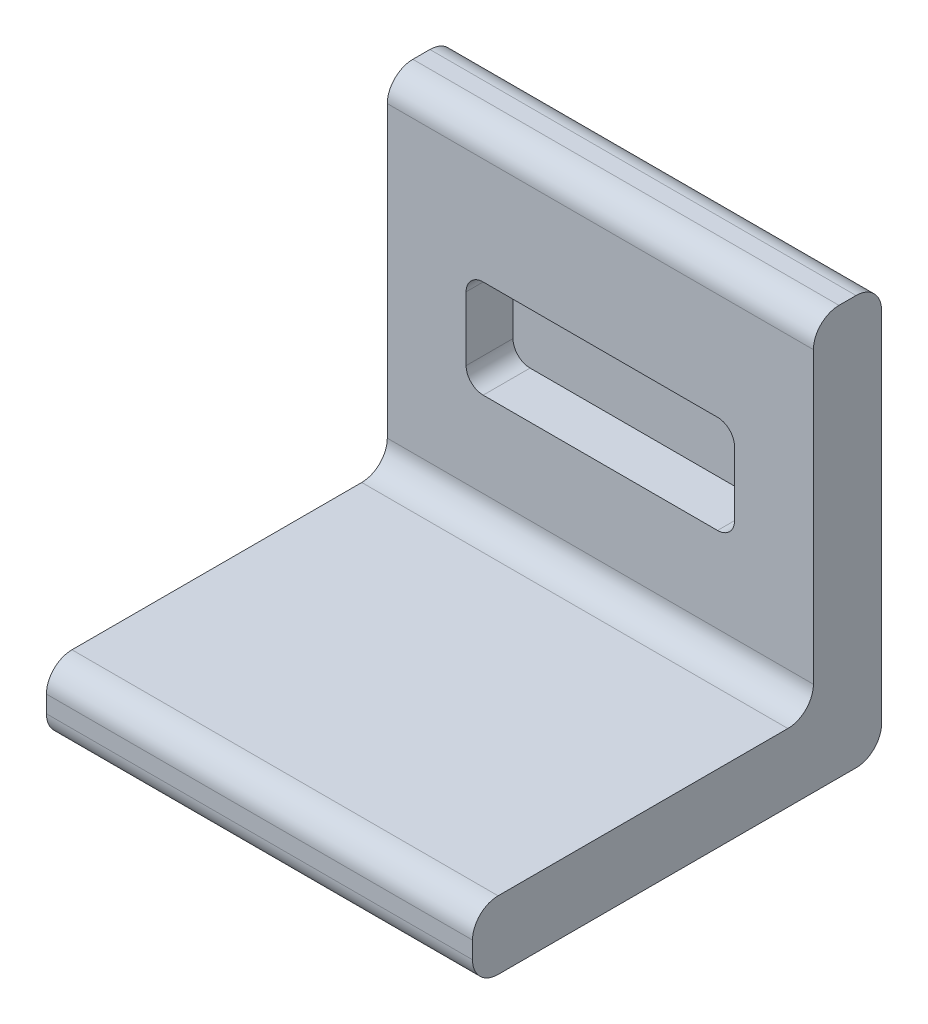
ISO-10303-21;
HEADER;
FILE_DESCRIPTION(('STEP AP214'),'2;1');
FILE_NAME('part.step','',(''),(''),'','','');
FILE_SCHEMA(('AUTOMOTIVE_DESIGN { 1 0 10303 214 1 1 1 1 }'));
ENDSEC;
DATA;
#1=APPLICATION_CONTEXT('core data for automotive mechanical design processes');
#2=APPLICATION_PROTOCOL_DEFINITION('international standard','automotive_design',2000,#1);
#3=PRODUCT_CONTEXT('',#1,'mechanical');
#4=PRODUCT('Part','Part','',(#3));
#5=PRODUCT_RELATED_PRODUCT_CATEGORY('part','',(#4));
#6=PRODUCT_DEFINITION_FORMATION('','',#4);
#7=PRODUCT_DEFINITION_CONTEXT('part definition',#1,'design');
#8=PRODUCT_DEFINITION('design','',#6,#7);
#9=PRODUCT_DEFINITION_SHAPE('','',#8);
#10=(LENGTH_UNIT() NAMED_UNIT(*) SI_UNIT(.MILLI.,.METRE.));
#11=(NAMED_UNIT(*) PLANE_ANGLE_UNIT() SI_UNIT($,.RADIAN.));
#12=(NAMED_UNIT(*) SI_UNIT($,.STERADIAN.) SOLID_ANGLE_UNIT());
#13=UNCERTAINTY_MEASURE_WITH_UNIT(LENGTH_MEASURE(1.E-05),#10,'distance_accuracy_value','');
#14=(GEOMETRIC_REPRESENTATION_CONTEXT(3) GLOBAL_UNCERTAINTY_ASSIGNED_CONTEXT((#13)) GLOBAL_UNIT_ASSIGNED_CONTEXT((#10,
#11,#12)) REPRESENTATION_CONTEXT('',''));
#15=CARTESIAN_POINT('',(0.,0.,0.));
#16=DIRECTION('',(0.,0.,1.));
#17=DIRECTION('',(1.,0.,0.));
#18=AXIS2_PLACEMENT_3D('',#15,#16,#17);
#19=CARTESIAN_POINT('',(-25.,8.,-40.));
#20=DIRECTION('',(1.,0.,0.));
#21=DIRECTION('',(0.,0.,-1.));
#22=AXIS2_PLACEMENT_3D('',#19,#20,#21);
#23=PLANE('',#22);
#24=DIRECTION('',(0.,-1.,0.));
#25=VECTOR('',#24,1.);
#26=CARTESIAN_POINT('',(-25.,8.,0.));
#27=LINE('',#26,#25);
#28=CARTESIAN_POINT('',(-25.,5.,0.));
#29=VERTEX_POINT('',#28);
#30=CARTESIAN_POINT('',(-25.,3.,0.));
#31=VERTEX_POINT('',#30);
#32=EDGE_CURVE('E265',#29,#31,#27,.T.);
#33=ORIENTED_EDGE('',*,*,#32,.F.);
#34=CARTESIAN_POINT('',(-25.,5.,-3.));
#35=DIRECTION('',(1.,0.,0.));
#36=DIRECTION('',(0.,0.,-1.));
#37=AXIS2_PLACEMENT_3D('',#34,#35,#36);
#38=CIRCLE('',#37,3.);
#39=CARTESIAN_POINT('',(-25.,8.,-3.));
#40=VERTEX_POINT('',#39);
#41=EDGE_CURVE('E355',#29,#40,#38,.F.);
#42=ORIENTED_EDGE('',*,*,#41,.T.);
#43=DIRECTION('',(0.,0.,1.));
#44=VECTOR('',#43,1.);
#45=CARTESIAN_POINT('',(-25.,8.,-40.));
#46=LINE('',#45,#44);
#47=CARTESIAN_POINT('',(-25.,8.,-37.));
#48=VERTEX_POINT('',#47);
#49=EDGE_CURVE('E246',#48,#40,#46,.T.);
#50=ORIENTED_EDGE('',*,*,#49,.F.);
#51=CARTESIAN_POINT('',(-25.,11.,-37.));
#52=DIRECTION('',(1.,0.,0.));
#53=DIRECTION('',(0.,0.,-1.));
#54=AXIS2_PLACEMENT_3D('',#51,#52,#53);
#55=CIRCLE('',#54,3.);
#56=CARTESIAN_POINT('',(-25.,11.,-40.));
#57=VERTEX_POINT('',#56);
#58=EDGE_CURVE('E48',#48,#57,#55,.T.);
#59=ORIENTED_EDGE('',*,*,#58,.T.);
#60=DIRECTION('',(0.,1.,0.));
#61=VECTOR('',#60,1.);
#62=CARTESIAN_POINT('',(-25.,48.,-40.));
#63=LINE('',#62,#61);
#64=CARTESIAN_POINT('',(-25.,45.,-40.));
#65=VERTEX_POINT('',#64);
#66=EDGE_CURVE('E226',#57,#65,#63,.T.);
#67=ORIENTED_EDGE('',*,*,#66,.T.);
#68=CARTESIAN_POINT('',(-25.,45.,-43.));
#69=DIRECTION('',(1.,0.,0.));
#70=DIRECTION('',(0.,0.,-1.));
#71=AXIS2_PLACEMENT_3D('',#68,#69,#70);
#72=CIRCLE('',#71,3.);
#73=CARTESIAN_POINT('',(-25.,48.,-43.));
#74=VERTEX_POINT('',#73);
#75=EDGE_CURVE('E352',#65,#74,#72,.F.);
#76=ORIENTED_EDGE('',*,*,#75,.T.);
#77=DIRECTION('',(0.,0.,1.));
#78=VECTOR('',#77,1.);
#79=CARTESIAN_POINT('',(-25.,48.,-48.));
#80=LINE('',#79,#78);
#81=CARTESIAN_POINT('',(-25.,48.,-45.));
#82=VERTEX_POINT('',#81);
#83=EDGE_CURVE('E241',#82,#74,#80,.T.);
#84=ORIENTED_EDGE('',*,*,#83,.F.);
#85=CARTESIAN_POINT('',(-25.,45.,-45.));
#86=DIRECTION('',(1.,0.,0.));
#87=DIRECTION('',(0.,0.,-1.));
#88=AXIS2_PLACEMENT_3D('',#85,#86,#87);
#89=CIRCLE('',#88,3.);
#90=CARTESIAN_POINT('',(-25.,45.,-48.));
#91=VERTEX_POINT('',#90);
#92=EDGE_CURVE('E55',#82,#91,#89,.F.);
#93=ORIENTED_EDGE('',*,*,#92,.T.);
#94=DIRECTION('',(0.,1.,0.));
#95=VECTOR('',#94,1.);
#96=CARTESIAN_POINT('',(-25.,48.,-48.));
#97=LINE('',#96,#95);
#98=CARTESIAN_POINT('',(-25.,3.,-48.));
#99=VERTEX_POINT('',#98);
#100=EDGE_CURVE('E225',#99,#91,#97,.T.);
#101=ORIENTED_EDGE('',*,*,#100,.F.);
#102=CARTESIAN_POINT('',(-25.,3.,-45.));
#103=DIRECTION('',(1.,0.,0.));
#104=DIRECTION('',(0.,0.,-1.));
#105=AXIS2_PLACEMENT_3D('',#102,#103,#104);
#106=CIRCLE('',#105,3.);
#107=CARTESIAN_POINT('',(-25.,0.,-45.));
#108=VERTEX_POINT('',#107);
#109=EDGE_CURVE('E63',#99,#108,#106,.F.);
#110=ORIENTED_EDGE('',*,*,#109,.T.);
#111=DIRECTION('',(0.,0.,1.));
#112=VECTOR('',#111,1.);
#113=CARTESIAN_POINT('',(-25.,0.,-40.));
#114=LINE('',#113,#112);
#115=CARTESIAN_POINT('',(-25.,0.,-3.));
#116=VERTEX_POINT('',#115);
#117=EDGE_CURVE('E245',#108,#116,#114,.T.);
#118=ORIENTED_EDGE('',*,*,#117,.T.);
#119=CARTESIAN_POINT('',(-25.,3.,-3.));
#120=DIRECTION('',(1.,0.,0.));
#121=DIRECTION('',(0.,0.,-1.));
#122=AXIS2_PLACEMENT_3D('',#119,#120,#121);
#123=CIRCLE('',#122,3.);
#124=EDGE_CURVE('E347',#116,#31,#123,.F.);
#125=ORIENTED_EDGE('',*,*,#124,.T.);
#126=EDGE_LOOP('',(#33,#42,#50,#59,#67,#76,#84,#93,#101,#110,#118,#125));
#127=FACE_BOUND('',#126,.T.);
#128=ADVANCED_FACE('F39',(#127),#23,.F.);
#129=CARTESIAN_POINT('',(-25.,8.,0.));
#130=DIRECTION('',(0.,0.,-1.));
#131=DIRECTION('',(-1.,0.,0.));
#132=AXIS2_PLACEMENT_3D('',#129,#130,#131);
#133=PLANE('',#132);
#134=DIRECTION('',(0.,-1.,0.));
#135=VECTOR('',#134,1.);
#136=CARTESIAN_POINT('',(25.,8.,0.));
#137=LINE('',#136,#135);
#138=CARTESIAN_POINT('',(25.,5.,0.));
#139=VERTEX_POINT('',#138);
#140=CARTESIAN_POINT('',(25.,3.,0.));
#141=VERTEX_POINT('',#140);
#142=EDGE_CURVE('E255',#139,#141,#137,.T.);
#143=ORIENTED_EDGE('',*,*,#142,.F.);
#144=DIRECTION('',(1.,0.,0.));
#145=VECTOR('',#144,1.);
#146=CARTESIAN_POINT('',(-25.,5.,0.));
#147=LINE('',#146,#145);
#148=EDGE_CURVE('E342',#139,#29,#147,.F.);
#149=ORIENTED_EDGE('',*,*,#148,.T.);
#150=ORIENTED_EDGE('',*,*,#32,.T.);
#151=DIRECTION('',(1.,0.,0.));
#152=VECTOR('',#151,1.);
#153=CARTESIAN_POINT('',(-25.,3.,0.));
#154=LINE('',#153,#152);
#155=EDGE_CURVE('E338',#31,#141,#154,.T.);
#156=ORIENTED_EDGE('',*,*,#155,.T.);
#157=EDGE_LOOP('',(#143,#149,#150,#156));
#158=FACE_BOUND('',#157,.T.);
#159=ADVANCED_FACE('F401',(#158),#133,.F.);
#160=CARTESIAN_POINT('',(25.,8.,-40.));
#161=DIRECTION('',(-1.,0.,0.));
#162=DIRECTION('',(0.,0.,1.));
#163=AXIS2_PLACEMENT_3D('',#160,#161,#162);
#164=PLANE('',#163);
#165=DIRECTION('',(0.,0.,-1.));
#166=VECTOR('',#165,1.);
#167=CARTESIAN_POINT('',(25.,8.,-40.));
#168=LINE('',#167,#166);
#169=CARTESIAN_POINT('',(25.,8.,-3.));
#170=VERTEX_POINT('',#169);
#171=CARTESIAN_POINT('',(25.,8.,-37.));
#172=VERTEX_POINT('',#171);
#173=EDGE_CURVE('E250',#170,#172,#168,.T.);
#174=ORIENTED_EDGE('',*,*,#173,.F.);
#175=CARTESIAN_POINT('',(25.,5.,-3.));
#176=DIRECTION('',(-1.,0.,0.));
#177=DIRECTION('',(0.,0.,1.));
#178=AXIS2_PLACEMENT_3D('',#175,#176,#177);
#179=CIRCLE('',#178,3.);
#180=EDGE_CURVE('E335',#170,#139,#179,.F.);
#181=ORIENTED_EDGE('',*,*,#180,.T.);
#182=ORIENTED_EDGE('',*,*,#142,.T.);
#183=CARTESIAN_POINT('',(25.,3.,-3.));
#184=DIRECTION('',(-1.,0.,0.));
#185=DIRECTION('',(0.,0.,1.));
#186=AXIS2_PLACEMENT_3D('',#183,#184,#185);
#187=CIRCLE('',#186,3.);
#188=CARTESIAN_POINT('',(25.,0.,-3.));
#189=VERTEX_POINT('',#188);
#190=EDGE_CURVE('E326',#141,#189,#187,.F.);
#191=ORIENTED_EDGE('',*,*,#190,.T.);
#192=DIRECTION('',(0.,0.,-1.));
#193=VECTOR('',#192,1.);
#194=CARTESIAN_POINT('',(25.,0.,-40.));
#195=LINE('',#194,#193);
#196=CARTESIAN_POINT('',(25.,0.,-45.));
#197=VERTEX_POINT('',#196);
#198=EDGE_CURVE('E251',#189,#197,#195,.T.);
#199=ORIENTED_EDGE('',*,*,#198,.T.);
#200=CARTESIAN_POINT('',(25.,3.,-45.));
#201=DIRECTION('',(-1.,0.,0.));
#202=DIRECTION('',(0.,0.,1.));
#203=AXIS2_PLACEMENT_3D('',#200,#201,#202);
#204=CIRCLE('',#203,3.);
#205=CARTESIAN_POINT('',(25.,3.,-48.));
#206=VERTEX_POINT('',#205);
#207=EDGE_CURVE('E323',#197,#206,#204,.F.);
#208=ORIENTED_EDGE('',*,*,#207,.T.);
#209=DIRECTION('',(0.,-1.,0.));
#210=VECTOR('',#209,1.);
#211=CARTESIAN_POINT('',(25.,48.,-48.));
#212=LINE('',#211,#210);
#213=CARTESIAN_POINT('',(25.,45.,-48.));
#214=VERTEX_POINT('',#213);
#215=EDGE_CURVE('E221',#214,#206,#212,.T.);
#216=ORIENTED_EDGE('',*,*,#215,.F.);
#217=CARTESIAN_POINT('',(25.,45.,-45.));
#218=DIRECTION('',(-1.,0.,0.));
#219=DIRECTION('',(0.,0.,1.));
#220=AXIS2_PLACEMENT_3D('',#217,#218,#219);
#221=CIRCLE('',#220,3.);
#222=CARTESIAN_POINT('',(25.,48.,-45.));
#223=VERTEX_POINT('',#222);
#224=EDGE_CURVE('E329',#214,#223,#221,.F.);
#225=ORIENTED_EDGE('',*,*,#224,.T.);
#226=DIRECTION('',(0.,0.,1.));
#227=VECTOR('',#226,1.);
#228=CARTESIAN_POINT('',(25.,48.,-48.));
#229=LINE('',#228,#227);
#230=CARTESIAN_POINT('',(25.,48.,-43.));
#231=VERTEX_POINT('',#230);
#232=EDGE_CURVE('E229',#223,#231,#229,.T.);
#233=ORIENTED_EDGE('',*,*,#232,.T.);
#234=CARTESIAN_POINT('',(25.,45.,-43.));
#235=DIRECTION('',(-1.,0.,0.));
#236=DIRECTION('',(0.,0.,1.));
#237=AXIS2_PLACEMENT_3D('',#234,#235,#236);
#238=CIRCLE('',#237,3.);
#239=CARTESIAN_POINT('',(25.,45.,-40.));
#240=VERTEX_POINT('',#239);
#241=EDGE_CURVE('E332',#231,#240,#238,.F.);
#242=ORIENTED_EDGE('',*,*,#241,.T.);
#243=DIRECTION('',(0.,-1.,0.));
#244=VECTOR('',#243,1.);
#245=CARTESIAN_POINT('',(25.,48.,-40.));
#246=LINE('',#245,#244);
#247=CARTESIAN_POINT('',(25.,11.,-40.));
#248=VERTEX_POINT('',#247);
#249=EDGE_CURVE('E230',#240,#248,#246,.T.);
#250=ORIENTED_EDGE('',*,*,#249,.T.);
#251=CARTESIAN_POINT('',(25.,11.,-37.));
#252=DIRECTION('',(-1.,0.,0.));
#253=DIRECTION('',(0.,0.,1.));
#254=AXIS2_PLACEMENT_3D('',#251,#252,#253);
#255=CIRCLE('',#254,3.);
#256=EDGE_CURVE('E11',#248,#172,#255,.T.);
#257=ORIENTED_EDGE('',*,*,#256,.T.);
#258=EDGE_LOOP('',(#174,#181,#182,#191,#199,#208,#216,#225,#233,#242,#250,#257));
#259=FACE_BOUND('',#258,.T.);
#260=ADVANCED_FACE('F391',(#259),#164,.F.);
#261=CARTESIAN_POINT('',(0.,8.,0.));
#262=DIRECTION('',(0.,1.,0.));
#263=DIRECTION('',(0.,0.,1.));
#264=AXIS2_PLACEMENT_3D('',#261,#262,#263);
#265=PLANE('',#264);
#266=ORIENTED_EDGE('',*,*,#173,.T.);
#267=DIRECTION('',(-1.,0.,0.));
#268=VECTOR('',#267,1.);
#269=CARTESIAN_POINT('',(0.,8.,-37.));
#270=LINE('',#269,#268);
#271=EDGE_CURVE('E313',#172,#48,#270,.T.);
#272=ORIENTED_EDGE('',*,*,#271,.T.);
#273=ORIENTED_EDGE('',*,*,#49,.T.);
#274=DIRECTION('',(1.,0.,0.));
#275=VECTOR('',#274,1.);
#276=CARTESIAN_POINT('',(25.,8.,-3.));
#277=LINE('',#276,#275);
#278=EDGE_CURVE('E309',#40,#170,#277,.T.);
#279=ORIENTED_EDGE('',*,*,#278,.T.);
#280=EDGE_LOOP('',(#266,#272,#273,#279));
#281=FACE_BOUND('',#280,.T.);
#282=ADVANCED_FACE('F393',(#281),#265,.T.);
#283=CARTESIAN_POINT('',(0.,0.,0.));
#284=DIRECTION('',(0.,1.,0.));
#285=DIRECTION('',(0.,0.,1.));
#286=AXIS2_PLACEMENT_3D('',#283,#284,#285);
#287=PLANE('',#286);
#288=ORIENTED_EDGE('',*,*,#198,.F.);
#289=DIRECTION('',(1.,0.,0.));
#290=VECTOR('',#289,1.);
#291=CARTESIAN_POINT('',(0.,0.,-3.));
#292=LINE('',#291,#290);
#293=EDGE_CURVE('E375',#189,#116,#292,.F.);
#294=ORIENTED_EDGE('',*,*,#293,.T.);
#295=ORIENTED_EDGE('',*,*,#117,.F.);
#296=DIRECTION('',(-1.,0.,0.));
#297=VECTOR('',#296,1.);
#298=CARTESIAN_POINT('',(25.,0.,-45.));
#299=LINE('',#298,#297);
#300=EDGE_CURVE('E372',#108,#197,#299,.F.);
#301=ORIENTED_EDGE('',*,*,#300,.T.);
#302=EDGE_LOOP('',(#288,#294,#295,#301));
#303=FACE_BOUND('',#302,.T.);
#304=ADVANCED_FACE('F410',(#303),#287,.F.);
#305=CARTESIAN_POINT('',(25.,48.,-48.));
#306=DIRECTION('',(0.,-1.,0.));
#307=DIRECTION('',(0.,0.,-1.));
#308=AXIS2_PLACEMENT_3D('',#305,#306,#307);
#309=PLANE('',#308);
#310=ORIENTED_EDGE('',*,*,#83,.T.);
#311=DIRECTION('',(1.,0.,0.));
#312=VECTOR('',#311,1.);
#313=CARTESIAN_POINT('',(25.,48.,-43.));
#314=LINE('',#313,#312);
#315=EDGE_CURVE('E361',#74,#231,#314,.T.);
#316=ORIENTED_EDGE('',*,*,#315,.T.);
#317=ORIENTED_EDGE('',*,*,#232,.F.);
#318=DIRECTION('',(1.,0.,0.));
#319=VECTOR('',#318,1.);
#320=CARTESIAN_POINT('',(-25.,48.,-45.));
#321=LINE('',#320,#319);
#322=EDGE_CURVE('E358',#223,#82,#321,.F.);
#323=ORIENTED_EDGE('',*,*,#322,.T.);
#324=EDGE_LOOP('',(#310,#316,#317,#323));
#325=FACE_BOUND('',#324,.T.);
#326=ADVANCED_FACE('F421',(#325),#309,.F.);
#327=CARTESIAN_POINT('',(0.,0.,-48.));
#328=DIRECTION('',(0.,0.,-1.));
#329=DIRECTION('',(-1.,0.,0.));
#330=AXIS2_PLACEMENT_3D('',#327,#328,#329);
#331=PLANE('',#330);
#332=ORIENTED_EDGE('',*,*,#100,.T.);
#333=DIRECTION('',(1.,0.,0.));
#334=VECTOR('',#333,1.);
#335=CARTESIAN_POINT('',(25.,45.,-48.));
#336=LINE('',#335,#334);
#337=EDGE_CURVE('E368',#91,#214,#336,.T.);
#338=ORIENTED_EDGE('',*,*,#337,.T.);
#339=ORIENTED_EDGE('',*,*,#215,.T.);
#340=DIRECTION('',(-1.,0.,0.));
#341=VECTOR('',#340,1.);
#342=CARTESIAN_POINT('',(-25.,3.,-48.));
#343=LINE('',#342,#341);
#344=EDGE_CURVE('E365',#206,#99,#343,.T.);
#345=ORIENTED_EDGE('',*,*,#344,.T.);
#346=EDGE_LOOP('',(#332,#338,#339,#345));
#347=FACE_BOUND('',#346,.T.);
#348=ADVANCED_FACE('F414',(#347),#331,.T.);
#349=CARTESIAN_POINT('',(0.,0.,-40.));
#350=DIRECTION('',(0.,0.,-1.));
#351=DIRECTION('',(-1.,0.,0.));
#352=AXIS2_PLACEMENT_3D('',#349,#350,#351);
#353=PLANE('',#352);
#354=DIRECTION('',(1.,0.,0.));
#355=VECTOR('',#354,1.);
#356=CARTESIAN_POINT('',(-15.75,21.,-40.));
#357=LINE('',#356,#355);
#358=CARTESIAN_POINT('',(-13.75,21.,-40.));
#359=VERTEX_POINT('',#358);
#360=CARTESIAN_POINT('',(13.75,21.,-40.));
#361=VERTEX_POINT('',#360);
#362=EDGE_CURVE('E210',#359,#361,#357,.T.);
#363=ORIENTED_EDGE('',*,*,#362,.F.);
#364=CARTESIAN_POINT('',(-13.75,23.,-40.));
#365=DIRECTION('',(0.,0.,-1.));
#366=DIRECTION('',(-1.,0.,0.));
#367=AXIS2_PLACEMENT_3D('',#364,#365,#366);
#368=CIRCLE('',#367,2.);
#369=CARTESIAN_POINT('',(-15.75,23.,-40.));
#370=VERTEX_POINT('',#369);
#371=EDGE_CURVE('E306',#359,#370,#368,.T.);
#372=ORIENTED_EDGE('',*,*,#371,.T.);
#373=DIRECTION('',(0.,-1.,0.));
#374=VECTOR('',#373,1.);
#375=CARTESIAN_POINT('',(-15.75,32.5,-40.));
#376=LINE('',#375,#374);
#377=CARTESIAN_POINT('',(-15.75,30.5,-40.));
#378=VERTEX_POINT('',#377);
#379=EDGE_CURVE('E217',#378,#370,#376,.T.);
#380=ORIENTED_EDGE('',*,*,#379,.F.);
#381=CARTESIAN_POINT('',(-13.75,30.5,-40.));
#382=DIRECTION('',(0.,0.,-1.));
#383=DIRECTION('',(-1.,0.,0.));
#384=AXIS2_PLACEMENT_3D('',#381,#382,#383);
#385=CIRCLE('',#384,2.);
#386=CARTESIAN_POINT('',(-13.75,32.5,-40.));
#387=VERTEX_POINT('',#386);
#388=EDGE_CURVE('E303',#378,#387,#385,.T.);
#389=ORIENTED_EDGE('',*,*,#388,.T.);
#390=DIRECTION('',(-1.,0.,0.));
#391=VECTOR('',#390,1.);
#392=CARTESIAN_POINT('',(-15.75,32.5,-40.));
#393=LINE('',#392,#391);
#394=CARTESIAN_POINT('',(13.75,32.5,-40.));
#395=VERTEX_POINT('',#394);
#396=EDGE_CURVE('E209',#395,#387,#393,.T.);
#397=ORIENTED_EDGE('',*,*,#396,.F.);
#398=CARTESIAN_POINT('',(13.75,30.5,-40.));
#399=DIRECTION('',(0.,0.,-1.));
#400=DIRECTION('',(-1.,0.,0.));
#401=AXIS2_PLACEMENT_3D('',#398,#399,#400);
#402=CIRCLE('',#401,2.);
#403=CARTESIAN_POINT('',(15.75,30.5,-40.));
#404=VERTEX_POINT('',#403);
#405=EDGE_CURVE('E190',#395,#404,#402,.T.);
#406=ORIENTED_EDGE('',*,*,#405,.T.);
#407=DIRECTION('',(0.,1.,0.));
#408=VECTOR('',#407,1.);
#409=CARTESIAN_POINT('',(15.75,32.5,-40.));
#410=LINE('',#409,#408);
#411=CARTESIAN_POINT('',(15.75,23.,-40.));
#412=VERTEX_POINT('',#411);
#413=EDGE_CURVE('E197',#412,#404,#410,.T.);
#414=ORIENTED_EDGE('',*,*,#413,.F.);
#415=CARTESIAN_POINT('',(13.75,23.,-40.));
#416=DIRECTION('',(0.,0.,-1.));
#417=DIRECTION('',(-1.,0.,0.));
#418=AXIS2_PLACEMENT_3D('',#415,#416,#417);
#419=CIRCLE('',#418,2.);
#420=EDGE_CURVE('E179',#412,#361,#419,.T.);
#421=ORIENTED_EDGE('',*,*,#420,.T.);
#422=EDGE_LOOP('',(#363,#372,#380,#389,#397,#406,#414,#421));
#423=FACE_BOUND('',#422,.T.);
#424=ORIENTED_EDGE('',*,*,#66,.F.);
#425=DIRECTION('',(-1.,0.,0.));
#426=VECTOR('',#425,1.);
#427=CARTESIAN_POINT('',(0.,11.,-40.));
#428=LINE('',#427,#426);
#429=EDGE_CURVE('E320',#57,#248,#428,.F.);
#430=ORIENTED_EDGE('',*,*,#429,.T.);
#431=ORIENTED_EDGE('',*,*,#249,.F.);
#432=DIRECTION('',(1.,0.,0.));
#433=VECTOR('',#432,1.);
#434=CARTESIAN_POINT('',(0.,45.,-40.));
#435=LINE('',#434,#433);
#436=EDGE_CURVE('E317',#240,#65,#435,.F.);
#437=ORIENTED_EDGE('',*,*,#436,.T.);
#438=EDGE_LOOP('',(#424,#430,#431,#437));
#439=FACE_BOUND('',#438,.T.);
#440=ADVANCED_FACE('F205',(#423,#439),#353,.F.);
#441=CARTESIAN_POINT('',(-15.75,32.5,-45.5));
#442=DIRECTION('',(-1.,0.,0.));
#443=DIRECTION('',(0.,0.,1.));
#444=AXIS2_PLACEMENT_3D('',#441,#442,#443);
#445=PLANE('',#444);
#446=DIRECTION('',(0.,-1.,0.));
#447=VECTOR('',#446,1.);
#448=CARTESIAN_POINT('',(-15.75,32.5,-45.5));
#449=LINE('',#448,#447);
#450=CARTESIAN_POINT('',(-15.75,30.5,-45.5));
#451=VERTEX_POINT('',#450);
#452=CARTESIAN_POINT('',(-15.75,23.,-45.5));
#453=VERTEX_POINT('',#452);
#454=EDGE_CURVE('E215',#451,#453,#449,.T.);
#455=ORIENTED_EDGE('',*,*,#454,.F.);
#456=DIRECTION('',(0.,0.,1.));
#457=VECTOR('',#456,1.);
#458=CARTESIAN_POINT('',(-15.75,30.5,-40.));
#459=LINE('',#458,#457);
#460=EDGE_CURVE('E191',#451,#378,#459,.T.);
#461=ORIENTED_EDGE('',*,*,#460,.T.);
#462=ORIENTED_EDGE('',*,*,#379,.T.);
#463=DIRECTION('',(0.,0.,1.));
#464=VECTOR('',#463,1.);
#465=CARTESIAN_POINT('',(-15.75,23.,-45.5));
#466=LINE('',#465,#464);
#467=EDGE_CURVE('E295',#370,#453,#466,.F.);
#468=ORIENTED_EDGE('',*,*,#467,.T.);
#469=EDGE_LOOP('',(#455,#461,#462,#468));
#470=FACE_BOUND('',#469,.T.);
#471=ADVANCED_FACE('F546',(#470),#445,.F.);
#472=CARTESIAN_POINT('',(-15.75,32.5,-45.5));
#473=DIRECTION('',(0.,1.,0.));
#474=DIRECTION('',(0.,0.,1.));
#475=AXIS2_PLACEMENT_3D('',#472,#473,#474);
#476=PLANE('',#475);
#477=DIRECTION('',(-1.,0.,0.));
#478=VECTOR('',#477,1.);
#479=CARTESIAN_POINT('',(-15.75,32.5,-45.5));
#480=LINE('',#479,#478);
#481=CARTESIAN_POINT('',(13.75,32.5,-45.5));
#482=VERTEX_POINT('',#481);
#483=CARTESIAN_POINT('',(-13.75,32.5,-45.5));
#484=VERTEX_POINT('',#483);
#485=EDGE_CURVE('E234',#482,#484,#480,.T.);
#486=ORIENTED_EDGE('',*,*,#485,.F.);
#487=DIRECTION('',(0.,0.,1.));
#488=VECTOR('',#487,1.);
#489=CARTESIAN_POINT('',(13.75,32.5,-40.));
#490=LINE('',#489,#488);
#491=EDGE_CURVE('E291',#482,#395,#490,.T.);
#492=ORIENTED_EDGE('',*,*,#491,.T.);
#493=ORIENTED_EDGE('',*,*,#396,.T.);
#494=DIRECTION('',(0.,0.,1.));
#495=VECTOR('',#494,1.);
#496=CARTESIAN_POINT('',(-13.75,32.5,-45.5));
#497=LINE('',#496,#495);
#498=EDGE_CURVE('E288',#387,#484,#497,.F.);
#499=ORIENTED_EDGE('',*,*,#498,.T.);
#500=EDGE_LOOP('',(#486,#492,#493,#499));
#501=FACE_BOUND('',#500,.T.);
#502=ADVANCED_FACE('F538',(#501),#476,.F.);
#503=CARTESIAN_POINT('',(15.75,32.5,-45.5));
#504=DIRECTION('',(1.,0.,0.));
#505=DIRECTION('',(0.,0.,-1.));
#506=AXIS2_PLACEMENT_3D('',#503,#504,#505);
#507=PLANE('',#506);
#508=DIRECTION('',(0.,1.,0.));
#509=VECTOR('',#508,1.);
#510=CARTESIAN_POINT('',(15.75,32.5,-45.5));
#511=LINE('',#510,#509);
#512=CARTESIAN_POINT('',(15.75,23.,-45.5));
#513=VERTEX_POINT('',#512);
#514=CARTESIAN_POINT('',(15.75,30.5,-45.5));
#515=VERTEX_POINT('',#514);
#516=EDGE_CURVE('E200',#513,#515,#511,.T.);
#517=ORIENTED_EDGE('',*,*,#516,.F.);
#518=DIRECTION('',(0.,0.,1.));
#519=VECTOR('',#518,1.);
#520=CARTESIAN_POINT('',(15.75,23.,-40.));
#521=LINE('',#520,#519);
#522=EDGE_CURVE('E183',#513,#412,#521,.T.);
#523=ORIENTED_EDGE('',*,*,#522,.T.);
#524=ORIENTED_EDGE('',*,*,#413,.T.);
#525=DIRECTION('',(0.,0.,1.));
#526=VECTOR('',#525,1.);
#527=CARTESIAN_POINT('',(15.75,30.5,-45.5));
#528=LINE('',#527,#526);
#529=EDGE_CURVE('E203',#404,#515,#528,.F.);
#530=ORIENTED_EDGE('',*,*,#529,.T.);
#531=EDGE_LOOP('',(#517,#523,#524,#530));
#532=FACE_BOUND('',#531,.T.);
#533=ADVANCED_FACE('F196',(#532),#507,.F.);
#534=CARTESIAN_POINT('',(-15.75,21.,-45.5));
#535=DIRECTION('',(0.,-1.,0.));
#536=DIRECTION('',(0.,0.,-1.));
#537=AXIS2_PLACEMENT_3D('',#534,#535,#536);
#538=PLANE('',#537);
#539=ORIENTED_EDGE('',*,*,#362,.T.);
#540=DIRECTION('',(0.,0.,1.));
#541=VECTOR('',#540,1.);
#542=CARTESIAN_POINT('',(13.75,21.,-45.5));
#543=LINE('',#542,#541);
#544=CARTESIAN_POINT('',(13.75,21.,-45.5));
#545=VERTEX_POINT('',#544);
#546=EDGE_CURVE('E184',#361,#545,#543,.F.);
#547=ORIENTED_EDGE('',*,*,#546,.T.);
#548=DIRECTION('',(1.,0.,0.));
#549=VECTOR('',#548,1.);
#550=CARTESIAN_POINT('',(-15.75,21.,-45.5));
#551=LINE('',#550,#549);
#552=CARTESIAN_POINT('',(-13.75,21.,-45.5));
#553=VERTEX_POINT('',#552);
#554=EDGE_CURVE('E638',#553,#545,#551,.T.);
#555=ORIENTED_EDGE('',*,*,#554,.F.);
#556=DIRECTION('',(0.,0.,1.));
#557=VECTOR('',#556,1.);
#558=CARTESIAN_POINT('',(-13.75,21.,-40.));
#559=LINE('',#558,#557);
#560=EDGE_CURVE('E202',#553,#359,#559,.T.);
#561=ORIENTED_EDGE('',*,*,#560,.T.);
#562=EDGE_LOOP('',(#539,#547,#555,#561));
#563=FACE_BOUND('',#562,.T.);
#564=ADVANCED_FACE('F521',(#563),#538,.F.);
#565=CARTESIAN_POINT('',(0.,0.,-45.5));
#566=DIRECTION('',(0.,0.,1.));
#567=DIRECTION('',(1.,0.,0.));
#568=AXIS2_PLACEMENT_3D('',#565,#566,#567);
#569=PLANE('',#568);
#570=ORIENTED_EDGE('',*,*,#554,.T.);
#571=CARTESIAN_POINT('',(13.75,23.,-45.5));
#572=DIRECTION('',(0.,0.,1.));
#573=DIRECTION('',(1.,0.,0.));
#574=AXIS2_PLACEMENT_3D('',#571,#572,#573);
#575=CIRCLE('',#574,2.);
#576=EDGE_CURVE('E285',#545,#513,#575,.T.);
#577=ORIENTED_EDGE('',*,*,#576,.T.);
#578=ORIENTED_EDGE('',*,*,#516,.T.);
#579=CARTESIAN_POINT('',(13.75,30.5,-45.5));
#580=DIRECTION('',(0.,0.,1.));
#581=DIRECTION('',(1.,0.,0.));
#582=AXIS2_PLACEMENT_3D('',#579,#580,#581);
#583=CIRCLE('',#582,2.);
#584=EDGE_CURVE('E282',#515,#482,#583,.T.);
#585=ORIENTED_EDGE('',*,*,#584,.T.);
#586=ORIENTED_EDGE('',*,*,#485,.T.);
#587=CARTESIAN_POINT('',(-13.75,30.5,-45.5));
#588=DIRECTION('',(0.,0.,1.));
#589=DIRECTION('',(1.,0.,0.));
#590=AXIS2_PLACEMENT_3D('',#587,#588,#589);
#591=CIRCLE('',#590,2.);
#592=EDGE_CURVE('E279',#484,#451,#591,.T.);
#593=ORIENTED_EDGE('',*,*,#592,.T.);
#594=ORIENTED_EDGE('',*,*,#454,.T.);
#595=CARTESIAN_POINT('',(-13.75,23.,-45.5));
#596=DIRECTION('',(0.,0.,1.));
#597=DIRECTION('',(1.,0.,0.));
#598=AXIS2_PLACEMENT_3D('',#595,#596,#597);
#599=CIRCLE('',#598,2.);
#600=EDGE_CURVE('E276',#453,#553,#599,.T.);
#601=ORIENTED_EDGE('',*,*,#600,.T.);
#602=EDGE_LOOP('',(#570,#577,#578,#585,#586,#593,#594,#601));
#603=FACE_BOUND('',#602,.T.);
#604=ADVANCED_FACE('F444',(#603),#569,.T.);
#605=CARTESIAN_POINT('',(13.75,23.,-45.5));
#606=DIRECTION('',(0.,0.,-1.));
#607=DIRECTION('',(-1.,0.,0.));
#608=AXIS2_PLACEMENT_3D('',#605,#606,#607);
#609=CYLINDRICAL_SURFACE('',#608,2.);
#610=ORIENTED_EDGE('',*,*,#576,.F.);
#611=ORIENTED_EDGE('',*,*,#546,.F.);
#612=ORIENTED_EDGE('',*,*,#420,.F.);
#613=ORIENTED_EDGE('',*,*,#522,.F.);
#614=EDGE_LOOP('',(#610,#611,#612,#613));
#615=FACE_BOUND('',#614,.T.);
#616=ADVANCED_FACE('F182',(#615),#609,.F.);
#617=CARTESIAN_POINT('',(13.75,30.5,-45.5));
#618=DIRECTION('',(0.,0.,-1.));
#619=DIRECTION('',(-1.,0.,0.));
#620=AXIS2_PLACEMENT_3D('',#617,#618,#619);
#621=CYLINDRICAL_SURFACE('',#620,2.);
#622=ORIENTED_EDGE('',*,*,#584,.F.);
#623=ORIENTED_EDGE('',*,*,#529,.F.);
#624=ORIENTED_EDGE('',*,*,#405,.F.);
#625=ORIENTED_EDGE('',*,*,#491,.F.);
#626=EDGE_LOOP('',(#622,#623,#624,#625));
#627=FACE_BOUND('',#626,.T.);
#628=ADVANCED_FACE('F443',(#627),#621,.F.);
#629=CARTESIAN_POINT('',(-13.75,30.5,-45.5));
#630=DIRECTION('',(0.,0.,-1.));
#631=DIRECTION('',(-1.,0.,0.));
#632=AXIS2_PLACEMENT_3D('',#629,#630,#631);
#633=CYLINDRICAL_SURFACE('',#632,2.);
#634=ORIENTED_EDGE('',*,*,#592,.F.);
#635=ORIENTED_EDGE('',*,*,#498,.F.);
#636=ORIENTED_EDGE('',*,*,#388,.F.);
#637=ORIENTED_EDGE('',*,*,#460,.F.);
#638=EDGE_LOOP('',(#634,#635,#636,#637));
#639=FACE_BOUND('',#638,.T.);
#640=ADVANCED_FACE('F447',(#639),#633,.F.);
#641=CARTESIAN_POINT('',(-13.75,23.,-45.5));
#642=DIRECTION('',(0.,0.,-1.));
#643=DIRECTION('',(-1.,0.,0.));
#644=AXIS2_PLACEMENT_3D('',#641,#642,#643);
#645=CYLINDRICAL_SURFACE('',#644,2.);
#646=ORIENTED_EDGE('',*,*,#600,.F.);
#647=ORIENTED_EDGE('',*,*,#467,.F.);
#648=ORIENTED_EDGE('',*,*,#371,.F.);
#649=ORIENTED_EDGE('',*,*,#560,.F.);
#650=EDGE_LOOP('',(#646,#647,#648,#649));
#651=FACE_BOUND('',#650,.T.);
#652=ADVANCED_FACE('F451',(#651),#645,.F.);
#653=CARTESIAN_POINT('',(0.,11.,-37.));
#654=DIRECTION('',(-1.,0.,0.));
#655=DIRECTION('',(0.,0.,1.));
#656=AXIS2_PLACEMENT_3D('',#653,#654,#655);
#657=CYLINDRICAL_SURFACE('',#656,3.);
#658=ORIENTED_EDGE('',*,*,#256,.F.);
#659=ORIENTED_EDGE('',*,*,#429,.F.);
#660=ORIENTED_EDGE('',*,*,#58,.F.);
#661=ORIENTED_EDGE('',*,*,#271,.F.);
#662=EDGE_LOOP('',(#658,#659,#660,#661));
#663=FACE_BOUND('',#662,.T.);
#664=ADVANCED_FACE('F388',(#663),#657,.F.);
#665=CARTESIAN_POINT('',(0.,5.,-3.));
#666=DIRECTION('',(-1.,0.,0.));
#667=DIRECTION('',(0.,0.,1.));
#668=AXIS2_PLACEMENT_3D('',#665,#666,#667);
#669=CYLINDRICAL_SURFACE('',#668,3.);
#670=ORIENTED_EDGE('',*,*,#41,.F.);
#671=ORIENTED_EDGE('',*,*,#148,.F.);
#672=ORIENTED_EDGE('',*,*,#180,.F.);
#673=ORIENTED_EDGE('',*,*,#278,.F.);
#674=EDGE_LOOP('',(#670,#671,#672,#673));
#675=FACE_BOUND('',#674,.T.);
#676=ADVANCED_FACE('F397',(#675),#669,.T.);
#677=CARTESIAN_POINT('',(25.,45.,-43.));
#678=DIRECTION('',(1.,0.,0.));
#679=DIRECTION('',(0.,0.,-1.));
#680=AXIS2_PLACEMENT_3D('',#677,#678,#679);
#681=CYLINDRICAL_SURFACE('',#680,3.);
#682=ORIENTED_EDGE('',*,*,#75,.F.);
#683=ORIENTED_EDGE('',*,*,#436,.F.);
#684=ORIENTED_EDGE('',*,*,#241,.F.);
#685=ORIENTED_EDGE('',*,*,#315,.F.);
#686=EDGE_LOOP('',(#682,#683,#684,#685));
#687=FACE_BOUND('',#686,.T.);
#688=ADVANCED_FACE('F424',(#687),#681,.T.);
#689=CARTESIAN_POINT('',(0.,45.,-45.));
#690=DIRECTION('',(-1.,0.,0.));
#691=DIRECTION('',(0.,0.,1.));
#692=AXIS2_PLACEMENT_3D('',#689,#690,#691);
#693=CYLINDRICAL_SURFACE('',#692,3.);
#694=ORIENTED_EDGE('',*,*,#92,.F.);
#695=ORIENTED_EDGE('',*,*,#322,.F.);
#696=ORIENTED_EDGE('',*,*,#224,.F.);
#697=ORIENTED_EDGE('',*,*,#337,.F.);
#698=EDGE_LOOP('',(#694,#695,#696,#697));
#699=FACE_BOUND('',#698,.T.);
#700=ADVANCED_FACE('F417',(#699),#693,.T.);
#701=CARTESIAN_POINT('',(-25.,3.,-3.));
#702=DIRECTION('',(1.,0.,0.));
#703=DIRECTION('',(0.,0.,-1.));
#704=AXIS2_PLACEMENT_3D('',#701,#702,#703);
#705=CYLINDRICAL_SURFACE('',#704,3.);
#706=ORIENTED_EDGE('',*,*,#124,.F.);
#707=ORIENTED_EDGE('',*,*,#293,.F.);
#708=ORIENTED_EDGE('',*,*,#190,.F.);
#709=ORIENTED_EDGE('',*,*,#155,.F.);
#710=EDGE_LOOP('',(#706,#707,#708,#709));
#711=FACE_BOUND('',#710,.T.);
#712=ADVANCED_FACE('F405',(#711),#705,.T.);
#713=CARTESIAN_POINT('',(0.,3.,-45.));
#714=DIRECTION('',(1.,0.,0.));
#715=DIRECTION('',(0.,0.,-1.));
#716=AXIS2_PLACEMENT_3D('',#713,#714,#715);
#717=CYLINDRICAL_SURFACE('',#716,3.);
#718=ORIENTED_EDGE('',*,*,#207,.F.);
#719=ORIENTED_EDGE('',*,*,#300,.F.);
#720=ORIENTED_EDGE('',*,*,#109,.F.);
#721=ORIENTED_EDGE('',*,*,#344,.F.);
#722=EDGE_LOOP('',(#718,#719,#720,#721));
#723=FACE_BOUND('',#722,.T.);
#724=ADVANCED_FACE('F41',(#723),#717,.T.);
#725=CLOSED_SHELL('',(#128,#159,#260,#282,#304,#326,#348,#440,#471,#502,#533,#564,#604,#616,
#628,#640,#652,#664,#676,#688,#700,#712,#724));
#726=MANIFOLD_SOLID_BREP('B2',#725);
#727=ADVANCED_BREP_SHAPE_REPRESENTATION('',(#18,#726),#14);
#728=SHAPE_DEFINITION_REPRESENTATION(#9,#727);
ENDSEC;
END-ISO-10303-21;
